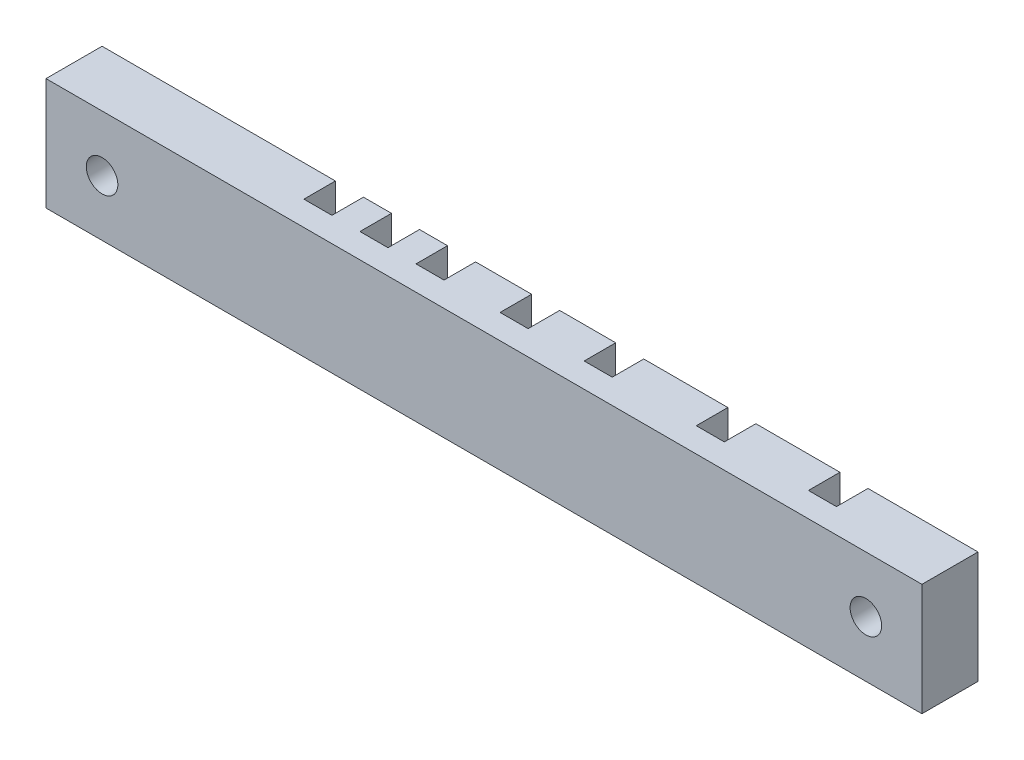
ISO-10303-21;
HEADER;
FILE_DESCRIPTION(('STEP AP214'),'2;1');
FILE_NAME('part.step','',(''),(''),'','','');
FILE_SCHEMA(('AUTOMOTIVE_DESIGN { 1 0 10303 214 1 1 1 1 }'));
ENDSEC;
DATA;
#1=APPLICATION_CONTEXT('core data for automotive mechanical design processes');
#2=APPLICATION_PROTOCOL_DEFINITION('international standard','automotive_design',2000,#1);
#3=PRODUCT_CONTEXT('',#1,'mechanical');
#4=PRODUCT('Part','Part','',(#3));
#5=PRODUCT_RELATED_PRODUCT_CATEGORY('part','',(#4));
#6=PRODUCT_DEFINITION_FORMATION('','',#4);
#7=PRODUCT_DEFINITION_CONTEXT('part definition',#1,'design');
#8=PRODUCT_DEFINITION('design','',#6,#7);
#9=PRODUCT_DEFINITION_SHAPE('','',#8);
#10=(LENGTH_UNIT() NAMED_UNIT(*) SI_UNIT(.MILLI.,.METRE.));
#11=(NAMED_UNIT(*) PLANE_ANGLE_UNIT() SI_UNIT($,.RADIAN.));
#12=(NAMED_UNIT(*) SI_UNIT($,.STERADIAN.) SOLID_ANGLE_UNIT());
#13=UNCERTAINTY_MEASURE_WITH_UNIT(LENGTH_MEASURE(1.E-05),#10,'distance_accuracy_value','');
#14=(GEOMETRIC_REPRESENTATION_CONTEXT(3) GLOBAL_UNCERTAINTY_ASSIGNED_CONTEXT((#13)) GLOBAL_UNIT_ASSIGNED_CONTEXT((#10,
#11,#12)) REPRESENTATION_CONTEXT('',''));
#15=CARTESIAN_POINT('',(0.,0.,0.));
#16=DIRECTION('',(0.,0.,1.));
#17=DIRECTION('',(1.,0.,0.));
#18=AXIS2_PLACEMENT_3D('',#15,#16,#17);
#19=CARTESIAN_POINT('',(0.,0.,0.));
#20=DIRECTION('',(0.,0.,1.));
#21=DIRECTION('',(1.,0.,0.));
#22=AXIS2_PLACEMENT_3D('',#19,#20,#21);
#23=PLANE('',#22);
#24=DIRECTION('',(1.,0.,0.));
#25=VECTOR('',#24,1.);
#26=CARTESIAN_POINT('',(-58.792924037461,-1.75702393340271,0.));
#27=LINE('',#26,#25);
#28=CARTESIAN_POINT('',(34.507075962539,-1.75702393340271,0.));
#29=VERTEX_POINT('',#28);
#30=CARTESIAN_POINT('',(46.507075962539,-1.75702393340271,0.));
#31=VERTEX_POINT('',#30);
#32=EDGE_CURVE('E417',#29,#31,#27,.T.);
#33=ORIENTED_EDGE('',*,*,#32,.F.);
#34=DIRECTION('',(0.,1.,0.));
#35=VECTOR('',#34,1.);
#36=CARTESIAN_POINT('',(34.507075962539,0.,0.));
#37=LINE('',#36,#35);
#38=CARTESIAN_POINT('',(34.507075962539,14.2429760665973,0.));
#39=VERTEX_POINT('',#38);
#40=EDGE_CURVE('E11',#29,#39,#37,.T.);
#41=ORIENTED_EDGE('',*,*,#40,.T.);
#42=DIRECTION('',(-1.,0.,0.));
#43=VECTOR('',#42,1.);
#44=CARTESIAN_POINT('',(-58.792924037461,14.2429760665973,0.));
#45=LINE('',#44,#43);
#46=CARTESIAN_POINT('',(46.507075962539,14.2429760665973,0.));
#47=VERTEX_POINT('',#46);
#48=EDGE_CURVE('E422',#47,#39,#45,.T.);
#49=ORIENTED_EDGE('',*,*,#48,.F.);
#50=DIRECTION('',(0.,-1.,0.));
#51=VECTOR('',#50,1.);
#52=CARTESIAN_POINT('',(46.507075962539,0.,0.));
#53=LINE('',#52,#51);
#54=EDGE_CURVE('E434',#47,#31,#53,.T.);
#55=ORIENTED_EDGE('',*,*,#54,.T.);
#56=EDGE_LOOP('',(#33,#41,#49,#55));
#57=FACE_BOUND('',#56,.T.);
#58=ADVANCED_FACE('F33',(#57),#23,.F.);
#59=CARTESIAN_POINT('',(30.507075962539,14.2429760665973,0.));
#60=VERTEX_POINT('',#59);
#61=CARTESIAN_POINT('',(18.507075962539,14.2429760665973,0.));
#62=VERTEX_POINT('',#61);
#63=EDGE_CURVE('E472',#60,#62,#45,.T.);
#64=ORIENTED_EDGE('',*,*,#63,.F.);
#65=DIRECTION('',(0.,-1.,0.));
#66=VECTOR('',#65,1.);
#67=CARTESIAN_POINT('',(30.507075962539,0.,0.));
#68=LINE('',#67,#66);
#69=CARTESIAN_POINT('',(30.507075962539,-1.75702393340271,0.));
#70=VERTEX_POINT('',#69);
#71=EDGE_CURVE('E41',#60,#70,#68,.T.);
#72=ORIENTED_EDGE('',*,*,#71,.T.);
#73=CARTESIAN_POINT('',(18.507075962539,-1.75702393340271,0.));
#74=VERTEX_POINT('',#73);
#75=EDGE_CURVE('E261',#74,#70,#27,.T.);
#76=ORIENTED_EDGE('',*,*,#75,.F.);
#77=DIRECTION('',(0.,1.,0.));
#78=VECTOR('',#77,1.);
#79=CARTESIAN_POINT('',(18.507075962539,0.,0.));
#80=LINE('',#79,#78);
#81=EDGE_CURVE('E466',#74,#62,#80,.T.);
#82=ORIENTED_EDGE('',*,*,#81,.T.);
#83=EDGE_LOOP('',(#64,#72,#76,#82));
#84=FACE_BOUND('',#83,.T.);
#85=ADVANCED_FACE('F470',(#84),#23,.F.);
#86=CARTESIAN_POINT('',(14.507075962539,14.2429760665973,0.));
#87=VERTEX_POINT('',#86);
#88=CARTESIAN_POINT('',(6.50707596253902,14.2429760665973,0.));
#89=VERTEX_POINT('',#88);
#90=EDGE_CURVE('E503',#87,#89,#45,.T.);
#91=ORIENTED_EDGE('',*,*,#90,.F.);
#92=DIRECTION('',(0.,-1.,0.));
#93=VECTOR('',#92,1.);
#94=CARTESIAN_POINT('',(14.507075962539,0.,0.));
#95=LINE('',#94,#93);
#96=CARTESIAN_POINT('',(14.507075962539,-1.75702393340271,0.));
#97=VERTEX_POINT('',#96);
#98=EDGE_CURVE('E464',#87,#97,#95,.T.);
#99=ORIENTED_EDGE('',*,*,#98,.T.);
#100=CARTESIAN_POINT('',(6.50707596253902,-1.75702393340271,0.));
#101=VERTEX_POINT('',#100);
#102=EDGE_CURVE('E485',#101,#97,#27,.T.);
#103=ORIENTED_EDGE('',*,*,#102,.F.);
#104=DIRECTION('',(0.,1.,0.));
#105=VECTOR('',#104,1.);
#106=CARTESIAN_POINT('',(6.50707596253902,0.,0.));
#107=LINE('',#106,#105);
#108=EDGE_CURVE('E461',#101,#89,#107,.T.);
#109=ORIENTED_EDGE('',*,*,#108,.T.);
#110=EDGE_LOOP('',(#91,#99,#103,#109));
#111=FACE_BOUND('',#110,.T.);
#112=ADVANCED_FACE('F501',(#111),#23,.F.);
#113=CARTESIAN_POINT('',(2.50707596253902,14.2429760665973,0.));
#114=VERTEX_POINT('',#113);
#115=CARTESIAN_POINT('',(-5.49292403746098,14.2429760665973,0.));
#116=VERTEX_POINT('',#115);
#117=EDGE_CURVE('E617',#114,#116,#45,.T.);
#118=ORIENTED_EDGE('',*,*,#117,.F.);
#119=DIRECTION('',(0.,-1.,0.));
#120=VECTOR('',#119,1.);
#121=CARTESIAN_POINT('',(2.50707596253902,0.,0.));
#122=LINE('',#121,#120);
#123=CARTESIAN_POINT('',(2.50707596253902,-1.75702393340271,0.));
#124=VERTEX_POINT('',#123);
#125=EDGE_CURVE('E458',#114,#124,#122,.T.);
#126=ORIENTED_EDGE('',*,*,#125,.T.);
#127=CARTESIAN_POINT('',(-5.49292403746098,-1.75702393340271,0.));
#128=VERTEX_POINT('',#127);
#129=EDGE_CURVE('E492',#128,#124,#27,.T.);
#130=ORIENTED_EDGE('',*,*,#129,.F.);
#131=DIRECTION('',(0.,1.,0.));
#132=VECTOR('',#131,1.);
#133=CARTESIAN_POINT('',(-5.49292403746098,0.,0.));
#134=LINE('',#133,#132);
#135=EDGE_CURVE('E455',#128,#116,#134,.T.);
#136=ORIENTED_EDGE('',*,*,#135,.T.);
#137=EDGE_LOOP('',(#118,#126,#130,#136));
#138=FACE_BOUND('',#137,.T.);
#139=ADVANCED_FACE('F616',(#138),#23,.F.);
#140=CARTESIAN_POINT('',(-9.49292403746098,14.2429760665973,0.));
#141=VERTEX_POINT('',#140);
#142=CARTESIAN_POINT('',(-13.492924037461,14.2429760665973,0.));
#143=VERTEX_POINT('',#142);
#144=EDGE_CURVE('E602',#141,#143,#45,.T.);
#145=ORIENTED_EDGE('',*,*,#144,.F.);
#146=DIRECTION('',(0.,-1.,0.));
#147=VECTOR('',#146,1.);
#148=CARTESIAN_POINT('',(-9.49292403746098,0.,0.));
#149=LINE('',#148,#147);
#150=CARTESIAN_POINT('',(-9.49292403746097,-1.75702393340271,0.));
#151=VERTEX_POINT('',#150);
#152=EDGE_CURVE('E452',#141,#151,#149,.T.);
#153=ORIENTED_EDGE('',*,*,#152,.T.);
#154=CARTESIAN_POINT('',(-13.492924037461,-1.75702393340271,0.));
#155=VERTEX_POINT('',#154);
#156=EDGE_CURVE('E489',#155,#151,#27,.T.);
#157=ORIENTED_EDGE('',*,*,#156,.F.);
#158=DIRECTION('',(0.,1.,0.));
#159=VECTOR('',#158,1.);
#160=CARTESIAN_POINT('',(-13.492924037461,0.,0.));
#161=LINE('',#160,#159);
#162=EDGE_CURVE('E449',#155,#143,#161,.T.);
#163=ORIENTED_EDGE('',*,*,#162,.T.);
#164=EDGE_LOOP('',(#145,#153,#157,#163));
#165=FACE_BOUND('',#164,.T.);
#166=ADVANCED_FACE('F556',(#165),#23,.F.);
#167=CARTESIAN_POINT('',(-17.492924037461,14.2429760665973,0.));
#168=VERTEX_POINT('',#167);
#169=CARTESIAN_POINT('',(-21.492924037461,14.2429760665973,0.));
#170=VERTEX_POINT('',#169);
#171=EDGE_CURVE('E588',#168,#170,#45,.T.);
#172=ORIENTED_EDGE('',*,*,#171,.F.);
#173=DIRECTION('',(0.,-1.,0.));
#174=VECTOR('',#173,1.);
#175=CARTESIAN_POINT('',(-17.492924037461,0.,0.));
#176=LINE('',#175,#174);
#177=CARTESIAN_POINT('',(-17.492924037461,-1.75702393340271,0.));
#178=VERTEX_POINT('',#177);
#179=EDGE_CURVE('E446',#168,#178,#176,.T.);
#180=ORIENTED_EDGE('',*,*,#179,.T.);
#181=CARTESIAN_POINT('',(-21.492924037461,-1.75702393340271,0.));
#182=VERTEX_POINT('',#181);
#183=EDGE_CURVE('E416',#182,#178,#27,.T.);
#184=ORIENTED_EDGE('',*,*,#183,.F.);
#185=DIRECTION('',(0.,1.,0.));
#186=VECTOR('',#185,1.);
#187=CARTESIAN_POINT('',(-21.492924037461,0.,0.));
#188=LINE('',#187,#186);
#189=EDGE_CURVE('E443',#182,#170,#188,.T.);
#190=ORIENTED_EDGE('',*,*,#189,.T.);
#191=EDGE_LOOP('',(#172,#180,#184,#190));
#192=FACE_BOUND('',#191,.T.);
#193=ADVANCED_FACE('F549',(#192),#23,.F.);
#194=CARTESIAN_POINT('',(58.207075962539,6.24297606659729,0.));
#195=DIRECTION('',(0.,0.,-1.));
#196=DIRECTION('',(-1.,0.,0.));
#197=AXIS2_PLACEMENT_3D('',#194,#195,#196);
#198=CIRCLE('',#197,4.00000000000001);
#199=CARTESIAN_POINT('',(54.207075962539,6.24297606659729,0.));
#200=VERTEX_POINT('',#199);
#201=EDGE_CURVE('E561',#200,#200,#198,.T.);
#202=ORIENTED_EDGE('',*,*,#201,.F.);
#203=EDGE_LOOP('',(#202));
#204=FACE_BOUND('',#203,.T.);
#205=CARTESIAN_POINT('',(50.507075962539,-1.75702393340271,0.));
#206=VERTEX_POINT('',#205);
#207=CARTESIAN_POINT('',(66.207075962539,-1.75702393340271,0.));
#208=VERTEX_POINT('',#207);
#209=EDGE_CURVE('E411',#206,#208,#27,.T.);
#210=ORIENTED_EDGE('',*,*,#209,.F.);
#211=DIRECTION('',(0.,1.,0.));
#212=VECTOR('',#211,1.);
#213=CARTESIAN_POINT('',(50.507075962539,0.,0.));
#214=LINE('',#213,#212);
#215=CARTESIAN_POINT('',(50.507075962539,14.2429760665973,0.));
#216=VERTEX_POINT('',#215);
#217=EDGE_CURVE('E437',#206,#216,#214,.T.);
#218=ORIENTED_EDGE('',*,*,#217,.T.);
#219=CARTESIAN_POINT('',(66.207075962539,14.2429760665973,0.));
#220=VERTEX_POINT('',#219);
#221=EDGE_CURVE('E402',#220,#216,#45,.T.);
#222=ORIENTED_EDGE('',*,*,#221,.F.);
#223=DIRECTION('',(0.,1.,0.));
#224=VECTOR('',#223,1.);
#225=CARTESIAN_POINT('',(66.207075962539,14.2429760665973,0.));
#226=LINE('',#225,#224);
#227=EDGE_CURVE('E415',#208,#220,#226,.T.);
#228=ORIENTED_EDGE('',*,*,#227,.F.);
#229=EDGE_LOOP('',(#210,#218,#222,#228));
#230=FACE_BOUND('',#229,.T.);
#231=ADVANCED_FACE('F537',(#204,#230),#23,.F.);
#232=CARTESIAN_POINT('',(-58.792924037461,14.2429760665973,8.));
#233=DIRECTION('',(1.,0.,0.));
#234=DIRECTION('',(0.,0.,-1.));
#235=AXIS2_PLACEMENT_3D('',#232,#233,#234);
#236=PLANE('',#235);
#237=DIRECTION('',(0.,-1.,0.));
#238=VECTOR('',#237,1.);
#239=CARTESIAN_POINT('',(-58.792924037461,14.2429760665973,0.));
#240=LINE('',#239,#238);
#241=CARTESIAN_POINT('',(-58.792924037461,14.2429760665973,0.));
#242=VERTEX_POINT('',#241);
#243=CARTESIAN_POINT('',(-58.792924037461,-1.75702393340271,0.));
#244=VERTEX_POINT('',#243);
#245=EDGE_CURVE('E395',#242,#244,#240,.T.);
#246=ORIENTED_EDGE('',*,*,#245,.T.);
#247=DIRECTION('',(0.,0.,-1.));
#248=VECTOR('',#247,1.);
#249=CARTESIAN_POINT('',(-58.792924037461,-1.75702393340271,8.));
#250=LINE('',#249,#248);
#251=CARTESIAN_POINT('',(-58.792924037461,-1.75702393340271,8.));
#252=VERTEX_POINT('',#251);
#253=EDGE_CURVE('E431',#252,#244,#250,.T.);
#254=ORIENTED_EDGE('',*,*,#253,.F.);
#255=DIRECTION('',(0.,-1.,0.));
#256=VECTOR('',#255,1.);
#257=CARTESIAN_POINT('',(-58.792924037461,14.2429760665973,8.));
#258=LINE('',#257,#256);
#259=CARTESIAN_POINT('',(-58.792924037461,14.2429760665973,8.));
#260=VERTEX_POINT('',#259);
#261=EDGE_CURVE('E398',#260,#252,#258,.T.);
#262=ORIENTED_EDGE('',*,*,#261,.F.);
#263=DIRECTION('',(0.,0.,-1.));
#264=VECTOR('',#263,1.);
#265=CARTESIAN_POINT('',(-58.792924037461,14.2429760665973,8.));
#266=LINE('',#265,#264);
#267=EDGE_CURVE('E408',#260,#242,#266,.T.);
#268=ORIENTED_EDGE('',*,*,#267,.T.);
#269=EDGE_LOOP('',(#246,#254,#262,#268));
#270=FACE_BOUND('',#269,.T.);
#271=ADVANCED_FACE('F35',(#270),#236,.F.);
#272=CARTESIAN_POINT('',(-58.792924037461,-1.75702393340271,8.));
#273=DIRECTION('',(0.,1.,0.));
#274=DIRECTION('',(0.,0.,1.));
#275=AXIS2_PLACEMENT_3D('',#272,#273,#274);
#276=PLANE('',#275);
#277=DIRECTION('',(1.,0.,0.));
#278=VECTOR('',#277,1.);
#279=CARTESIAN_POINT('',(34.507075962539,-1.75702393340271,4.5));
#280=LINE('',#279,#278);
#281=CARTESIAN_POINT('',(30.507075962539,-1.75702393340271,4.5));
#282=VERTEX_POINT('',#281);
#283=CARTESIAN_POINT('',(34.507075962539,-1.75702393340271,4.5));
#284=VERTEX_POINT('',#283);
#285=EDGE_CURVE('E249',#282,#284,#280,.T.);
#286=ORIENTED_EDGE('',*,*,#285,.T.);
#287=DIRECTION('',(0.,0.,-1.));
#288=VECTOR('',#287,1.);
#289=CARTESIAN_POINT('',(34.507075962539,-1.75702393340271,4.5));
#290=LINE('',#289,#288);
#291=EDGE_CURVE('E262',#284,#29,#290,.T.);
#292=ORIENTED_EDGE('',*,*,#291,.T.);
#293=ORIENTED_EDGE('',*,*,#32,.T.);
#294=DIRECTION('',(0.,0.,1.));
#295=VECTOR('',#294,1.);
#296=CARTESIAN_POINT('',(46.507075962539,-1.75702393340271,4.5));
#297=LINE('',#296,#295);
#298=CARTESIAN_POINT('',(46.507075962539,-1.75702393340271,4.5));
#299=VERTEX_POINT('',#298);
#300=EDGE_CURVE('E380',#31,#299,#297,.T.);
#301=ORIENTED_EDGE('',*,*,#300,.T.);
#302=DIRECTION('',(1.,0.,0.));
#303=VECTOR('',#302,1.);
#304=CARTESIAN_POINT('',(50.507075962539,-1.75702393340271,4.5));
#305=LINE('',#304,#303);
#306=CARTESIAN_POINT('',(50.507075962539,-1.75702393340271,4.5));
#307=VERTEX_POINT('',#306);
#308=EDGE_CURVE('E384',#299,#307,#305,.T.);
#309=ORIENTED_EDGE('',*,*,#308,.T.);
#310=DIRECTION('',(0.,0.,-1.));
#311=VECTOR('',#310,1.);
#312=CARTESIAN_POINT('',(50.507075962539,-1.75702393340271,4.5));
#313=LINE('',#312,#311);
#314=EDGE_CURVE('E377',#307,#206,#313,.T.);
#315=ORIENTED_EDGE('',*,*,#314,.T.);
#316=ORIENTED_EDGE('',*,*,#209,.T.);
#317=DIRECTION('',(0.,0.,-1.));
#318=VECTOR('',#317,1.);
#319=CARTESIAN_POINT('',(66.207075962539,-1.75702393340271,8.));
#320=LINE('',#319,#318);
#321=CARTESIAN_POINT('',(66.207075962539,-1.75702393340271,8.));
#322=VERTEX_POINT('',#321);
#323=EDGE_CURVE('E428',#322,#208,#320,.T.);
#324=ORIENTED_EDGE('',*,*,#323,.F.);
#325=DIRECTION('',(1.,0.,0.));
#326=VECTOR('',#325,1.);
#327=CARTESIAN_POINT('',(-58.792924037461,-1.75702393340271,8.));
#328=LINE('',#327,#326);
#329=EDGE_CURVE('E401',#252,#322,#328,.T.);
#330=ORIENTED_EDGE('',*,*,#329,.F.);
#331=ORIENTED_EDGE('',*,*,#253,.T.);
#332=CARTESIAN_POINT('',(-25.492924037461,-1.75702393340271,0.));
#333=VERTEX_POINT('',#332);
#334=EDGE_CURVE('E412',#244,#333,#27,.T.);
#335=ORIENTED_EDGE('',*,*,#334,.T.);
#336=DIRECTION('',(0.,0.,1.));
#337=VECTOR('',#336,1.);
#338=CARTESIAN_POINT('',(-25.492924037461,-1.75702393340271,4.5));
#339=LINE('',#338,#337);
#340=CARTESIAN_POINT('',(-25.492924037461,-1.75702393340271,4.5));
#341=VERTEX_POINT('',#340);
#342=EDGE_CURVE('E359',#333,#341,#339,.T.);
#343=ORIENTED_EDGE('',*,*,#342,.T.);
#344=DIRECTION('',(1.,0.,0.));
#345=VECTOR('',#344,1.);
#346=CARTESIAN_POINT('',(-21.492924037461,-1.75702393340271,4.5));
#347=LINE('',#346,#345);
#348=CARTESIAN_POINT('',(-21.492924037461,-1.75702393340271,4.5));
#349=VERTEX_POINT('',#348);
#350=EDGE_CURVE('E363',#341,#349,#347,.T.);
#351=ORIENTED_EDGE('',*,*,#350,.T.);
#352=DIRECTION('',(0.,0.,-1.));
#353=VECTOR('',#352,1.);
#354=CARTESIAN_POINT('',(-21.492924037461,-1.75702393340271,4.5));
#355=LINE('',#354,#353);
#356=EDGE_CURVE('E356',#349,#182,#355,.T.);
#357=ORIENTED_EDGE('',*,*,#356,.T.);
#358=ORIENTED_EDGE('',*,*,#183,.T.);
#359=DIRECTION('',(0.,0.,1.));
#360=VECTOR('',#359,1.);
#361=CARTESIAN_POINT('',(-17.492924037461,-1.75702393340271,4.5));
#362=LINE('',#361,#360);
#363=CARTESIAN_POINT('',(-17.492924037461,-1.75702393340271,4.5));
#364=VERTEX_POINT('',#363);
#365=EDGE_CURVE('E338',#178,#364,#362,.T.);
#366=ORIENTED_EDGE('',*,*,#365,.T.);
#367=DIRECTION('',(1.,0.,0.));
#368=VECTOR('',#367,1.);
#369=CARTESIAN_POINT('',(-13.492924037461,-1.75702393340271,4.5));
#370=LINE('',#369,#368);
#371=CARTESIAN_POINT('',(-13.492924037461,-1.75702393340271,4.5));
#372=VERTEX_POINT('',#371);
#373=EDGE_CURVE('E342',#364,#372,#370,.T.);
#374=ORIENTED_EDGE('',*,*,#373,.T.);
#375=DIRECTION('',(0.,0.,-1.));
#376=VECTOR('',#375,1.);
#377=CARTESIAN_POINT('',(-13.492924037461,-1.75702393340271,4.5));
#378=LINE('',#377,#376);
#379=EDGE_CURVE('E335',#372,#155,#378,.T.);
#380=ORIENTED_EDGE('',*,*,#379,.T.);
#381=ORIENTED_EDGE('',*,*,#156,.T.);
#382=DIRECTION('',(0.,0.,1.));
#383=VECTOR('',#382,1.);
#384=CARTESIAN_POINT('',(-9.49292403746098,-1.75702393340271,4.5));
#385=LINE('',#384,#383);
#386=CARTESIAN_POINT('',(-9.49292403746098,-1.75702393340271,4.5));
#387=VERTEX_POINT('',#386);
#388=EDGE_CURVE('E317',#151,#387,#385,.T.);
#389=ORIENTED_EDGE('',*,*,#388,.T.);
#390=DIRECTION('',(1.,0.,0.));
#391=VECTOR('',#390,1.);
#392=CARTESIAN_POINT('',(-5.49292403746098,-1.75702393340271,4.5));
#393=LINE('',#392,#391);
#394=CARTESIAN_POINT('',(-5.49292403746098,-1.75702393340271,4.5));
#395=VERTEX_POINT('',#394);
#396=EDGE_CURVE('E321',#387,#395,#393,.T.);
#397=ORIENTED_EDGE('',*,*,#396,.T.);
#398=DIRECTION('',(0.,0.,-1.));
#399=VECTOR('',#398,1.);
#400=CARTESIAN_POINT('',(-5.49292403746098,-1.75702393340271,4.5));
#401=LINE('',#400,#399);
#402=EDGE_CURVE('E314',#395,#128,#401,.T.);
#403=ORIENTED_EDGE('',*,*,#402,.T.);
#404=ORIENTED_EDGE('',*,*,#129,.T.);
#405=DIRECTION('',(0.,0.,1.));
#406=VECTOR('',#405,1.);
#407=CARTESIAN_POINT('',(2.50707596253902,-1.75702393340271,4.5));
#408=LINE('',#407,#406);
#409=CARTESIAN_POINT('',(2.50707596253902,-1.75702393340271,4.5));
#410=VERTEX_POINT('',#409);
#411=EDGE_CURVE('E296',#124,#410,#408,.T.);
#412=ORIENTED_EDGE('',*,*,#411,.T.);
#413=DIRECTION('',(1.,0.,0.));
#414=VECTOR('',#413,1.);
#415=CARTESIAN_POINT('',(6.50707596253902,-1.75702393340271,4.5));
#416=LINE('',#415,#414);
#417=CARTESIAN_POINT('',(6.50707596253902,-1.75702393340271,4.5));
#418=VERTEX_POINT('',#417);
#419=EDGE_CURVE('E300',#410,#418,#416,.T.);
#420=ORIENTED_EDGE('',*,*,#419,.T.);
#421=DIRECTION('',(0.,0.,-1.));
#422=VECTOR('',#421,1.);
#423=CARTESIAN_POINT('',(6.50707596253902,-1.75702393340271,4.5));
#424=LINE('',#423,#422);
#425=EDGE_CURVE('E293',#418,#101,#424,.T.);
#426=ORIENTED_EDGE('',*,*,#425,.T.);
#427=ORIENTED_EDGE('',*,*,#102,.T.);
#428=DIRECTION('',(0.,0.,1.));
#429=VECTOR('',#428,1.);
#430=CARTESIAN_POINT('',(14.507075962539,-1.75702393340271,4.5));
#431=LINE('',#430,#429);
#432=CARTESIAN_POINT('',(14.507075962539,-1.75702393340271,4.5));
#433=VERTEX_POINT('',#432);
#434=EDGE_CURVE('E56',#97,#433,#431,.T.);
#435=ORIENTED_EDGE('',*,*,#434,.T.);
#436=DIRECTION('',(1.,0.,0.));
#437=VECTOR('',#436,1.);
#438=CARTESIAN_POINT('',(18.507075962539,-1.75702393340271,4.5));
#439=LINE('',#438,#437);
#440=CARTESIAN_POINT('',(18.507075962539,-1.75702393340271,4.5));
#441=VERTEX_POINT('',#440);
#442=EDGE_CURVE('E279',#433,#441,#439,.T.);
#443=ORIENTED_EDGE('',*,*,#442,.T.);
#444=DIRECTION('',(0.,0.,-1.));
#445=VECTOR('',#444,1.);
#446=CARTESIAN_POINT('',(18.507075962539,-1.75702393340271,4.5));
#447=LINE('',#446,#445);
#448=EDGE_CURVE('E275',#441,#74,#447,.T.);
#449=ORIENTED_EDGE('',*,*,#448,.T.);
#450=ORIENTED_EDGE('',*,*,#75,.T.);
#451=DIRECTION('',(0.,0.,1.));
#452=VECTOR('',#451,1.);
#453=CARTESIAN_POINT('',(30.507075962539,-1.75702393340271,4.5));
#454=LINE('',#453,#452);
#455=EDGE_CURVE('E48',#70,#282,#454,.T.);
#456=ORIENTED_EDGE('',*,*,#455,.T.);
#457=EDGE_LOOP('',(#286,#292,#293,#301,#309,#315,#316,#324,#330,#331,#335,#343,#351,#357,#358,
#366,#374,#380,#381,#389,#397,#403,#404,#412,#420,#426,#427,#435,#443,#449,#450,#456));
#458=FACE_BOUND('',#457,.T.);
#459=ADVANCED_FACE('F258',(#458),#276,.F.);
#460=CARTESIAN_POINT('',(66.207075962539,14.2429760665973,8.));
#461=DIRECTION('',(-1.,0.,0.));
#462=DIRECTION('',(0.,0.,1.));
#463=AXIS2_PLACEMENT_3D('',#460,#461,#462);
#464=PLANE('',#463);
#465=ORIENTED_EDGE('',*,*,#227,.T.);
#466=DIRECTION('',(0.,0.,-1.));
#467=VECTOR('',#466,1.);
#468=CARTESIAN_POINT('',(66.207075962539,14.2429760665973,8.));
#469=LINE('',#468,#467);
#470=CARTESIAN_POINT('',(66.207075962539,14.2429760665973,8.));
#471=VERTEX_POINT('',#470);
#472=EDGE_CURVE('E425',#471,#220,#469,.T.);
#473=ORIENTED_EDGE('',*,*,#472,.F.);
#474=DIRECTION('',(0.,1.,0.));
#475=VECTOR('',#474,1.);
#476=CARTESIAN_POINT('',(66.207075962539,14.2429760665973,8.));
#477=LINE('',#476,#475);
#478=EDGE_CURVE('E404',#322,#471,#477,.T.);
#479=ORIENTED_EDGE('',*,*,#478,.F.);
#480=ORIENTED_EDGE('',*,*,#323,.T.);
#481=EDGE_LOOP('',(#465,#473,#479,#480));
#482=FACE_BOUND('',#481,.T.);
#483=ADVANCED_FACE('F566',(#482),#464,.F.);
#484=CARTESIAN_POINT('',(-58.792924037461,14.2429760665973,8.));
#485=DIRECTION('',(0.,-1.,0.));
#486=DIRECTION('',(0.,0.,-1.));
#487=AXIS2_PLACEMENT_3D('',#484,#485,#486);
#488=PLANE('',#487);
#489=ORIENTED_EDGE('',*,*,#48,.T.);
#490=DIRECTION('',(0.,0.,-1.));
#491=VECTOR('',#490,1.);
#492=CARTESIAN_POINT('',(34.507075962539,14.2429760665973,4.5));
#493=LINE('',#492,#491);
#494=CARTESIAN_POINT('',(34.507075962539,14.2429760665973,4.5));
#495=VERTEX_POINT('',#494);
#496=EDGE_CURVE('E268',#495,#39,#493,.T.);
#497=ORIENTED_EDGE('',*,*,#496,.F.);
#498=DIRECTION('',(1.,0.,0.));
#499=VECTOR('',#498,1.);
#500=CARTESIAN_POINT('',(34.507075962539,14.2429760665973,4.5));
#501=LINE('',#500,#499);
#502=CARTESIAN_POINT('',(30.507075962539,14.2429760665973,4.5));
#503=VERTEX_POINT('',#502);
#504=EDGE_CURVE('E264',#503,#495,#501,.T.);
#505=ORIENTED_EDGE('',*,*,#504,.F.);
#506=DIRECTION('',(0.,0.,1.));
#507=VECTOR('',#506,1.);
#508=CARTESIAN_POINT('',(30.507075962539,14.2429760665973,4.5));
#509=LINE('',#508,#507);
#510=EDGE_CURVE('E244',#60,#503,#509,.T.);
#511=ORIENTED_EDGE('',*,*,#510,.F.);
#512=ORIENTED_EDGE('',*,*,#63,.T.);
#513=DIRECTION('',(0.,0.,-1.));
#514=VECTOR('',#513,1.);
#515=CARTESIAN_POINT('',(18.507075962539,14.2429760665973,4.5));
#516=LINE('',#515,#514);
#517=CARTESIAN_POINT('',(18.507075962539,14.2429760665973,4.5));
#518=VERTEX_POINT('',#517);
#519=EDGE_CURVE('E283',#518,#62,#516,.T.);
#520=ORIENTED_EDGE('',*,*,#519,.F.);
#521=DIRECTION('',(1.,0.,0.));
#522=VECTOR('',#521,1.);
#523=CARTESIAN_POINT('',(18.507075962539,14.2429760665973,4.5));
#524=LINE('',#523,#522);
#525=CARTESIAN_POINT('',(14.507075962539,14.2429760665973,4.5));
#526=VERTEX_POINT('',#525);
#527=EDGE_CURVE('E277',#526,#518,#524,.T.);
#528=ORIENTED_EDGE('',*,*,#527,.F.);
#529=DIRECTION('',(0.,0.,1.));
#530=VECTOR('',#529,1.);
#531=CARTESIAN_POINT('',(14.507075962539,14.2429760665973,4.5));
#532=LINE('',#531,#530);
#533=EDGE_CURVE('E285',#87,#526,#532,.T.);
#534=ORIENTED_EDGE('',*,*,#533,.F.);
#535=ORIENTED_EDGE('',*,*,#90,.T.);
#536=DIRECTION('',(0.,0.,-1.));
#537=VECTOR('',#536,1.);
#538=CARTESIAN_POINT('',(6.50707596253902,14.2429760665973,4.5));
#539=LINE('',#538,#537);
#540=CARTESIAN_POINT('',(6.50707596253902,14.2429760665973,4.5));
#541=VERTEX_POINT('',#540);
#542=EDGE_CURVE('E304',#541,#89,#539,.T.);
#543=ORIENTED_EDGE('',*,*,#542,.F.);
#544=DIRECTION('',(1.,0.,0.));
#545=VECTOR('',#544,1.);
#546=CARTESIAN_POINT('',(6.50707596253902,14.2429760665973,4.5));
#547=LINE('',#546,#545);
#548=CARTESIAN_POINT('',(2.50707596253902,14.2429760665973,4.5));
#549=VERTEX_POINT('',#548);
#550=EDGE_CURVE('E297',#549,#541,#547,.T.);
#551=ORIENTED_EDGE('',*,*,#550,.F.);
#552=DIRECTION('',(0.,0.,1.));
#553=VECTOR('',#552,1.);
#554=CARTESIAN_POINT('',(2.50707596253902,14.2429760665973,4.5));
#555=LINE('',#554,#553);
#556=EDGE_CURVE('E306',#114,#549,#555,.T.);
#557=ORIENTED_EDGE('',*,*,#556,.F.);
#558=ORIENTED_EDGE('',*,*,#117,.T.);
#559=DIRECTION('',(0.,0.,-1.));
#560=VECTOR('',#559,1.);
#561=CARTESIAN_POINT('',(-5.49292403746098,14.2429760665973,4.5));
#562=LINE('',#561,#560);
#563=CARTESIAN_POINT('',(-5.49292403746098,14.2429760665973,4.5));
#564=VERTEX_POINT('',#563);
#565=EDGE_CURVE('E325',#564,#116,#562,.T.);
#566=ORIENTED_EDGE('',*,*,#565,.F.);
#567=DIRECTION('',(1.,0.,0.));
#568=VECTOR('',#567,1.);
#569=CARTESIAN_POINT('',(-5.49292403746098,14.2429760665973,4.5));
#570=LINE('',#569,#568);
#571=CARTESIAN_POINT('',(-9.49292403746098,14.2429760665973,4.5));
#572=VERTEX_POINT('',#571);
#573=EDGE_CURVE('E318',#572,#564,#570,.T.);
#574=ORIENTED_EDGE('',*,*,#573,.F.);
#575=DIRECTION('',(0.,0.,1.));
#576=VECTOR('',#575,1.);
#577=CARTESIAN_POINT('',(-9.49292403746098,14.2429760665973,4.5));
#578=LINE('',#577,#576);
#579=EDGE_CURVE('E327',#141,#572,#578,.T.);
#580=ORIENTED_EDGE('',*,*,#579,.F.);
#581=ORIENTED_EDGE('',*,*,#144,.T.);
#582=DIRECTION('',(0.,0.,-1.));
#583=VECTOR('',#582,1.);
#584=CARTESIAN_POINT('',(-13.492924037461,14.2429760665973,4.5));
#585=LINE('',#584,#583);
#586=CARTESIAN_POINT('',(-13.492924037461,14.2429760665973,4.5));
#587=VERTEX_POINT('',#586);
#588=EDGE_CURVE('E346',#587,#143,#585,.T.);
#589=ORIENTED_EDGE('',*,*,#588,.F.);
#590=DIRECTION('',(1.,0.,0.));
#591=VECTOR('',#590,1.);
#592=CARTESIAN_POINT('',(-13.492924037461,14.2429760665973,4.5));
#593=LINE('',#592,#591);
#594=CARTESIAN_POINT('',(-17.492924037461,14.2429760665973,4.5));
#595=VERTEX_POINT('',#594);
#596=EDGE_CURVE('E339',#595,#587,#593,.T.);
#597=ORIENTED_EDGE('',*,*,#596,.F.);
#598=DIRECTION('',(0.,0.,1.));
#599=VECTOR('',#598,1.);
#600=CARTESIAN_POINT('',(-17.492924037461,14.2429760665973,4.5));
#601=LINE('',#600,#599);
#602=EDGE_CURVE('E348',#168,#595,#601,.T.);
#603=ORIENTED_EDGE('',*,*,#602,.F.);
#604=ORIENTED_EDGE('',*,*,#171,.T.);
#605=DIRECTION('',(0.,0.,-1.));
#606=VECTOR('',#605,1.);
#607=CARTESIAN_POINT('',(-21.492924037461,14.2429760665973,4.5));
#608=LINE('',#607,#606);
#609=CARTESIAN_POINT('',(-21.492924037461,14.2429760665973,4.5));
#610=VERTEX_POINT('',#609);
#611=EDGE_CURVE('E367',#610,#170,#608,.T.);
#612=ORIENTED_EDGE('',*,*,#611,.F.);
#613=DIRECTION('',(1.,0.,0.));
#614=VECTOR('',#613,1.);
#615=CARTESIAN_POINT('',(-21.492924037461,14.2429760665973,4.5));
#616=LINE('',#615,#614);
#617=CARTESIAN_POINT('',(-25.492924037461,14.2429760665973,4.5));
#618=VERTEX_POINT('',#617);
#619=EDGE_CURVE('E360',#618,#610,#616,.T.);
#620=ORIENTED_EDGE('',*,*,#619,.F.);
#621=DIRECTION('',(0.,0.,1.));
#622=VECTOR('',#621,1.);
#623=CARTESIAN_POINT('',(-25.492924037461,14.2429760665973,4.5));
#624=LINE('',#623,#622);
#625=CARTESIAN_POINT('',(-25.492924037461,14.2429760665973,0.));
#626=VERTEX_POINT('',#625);
#627=EDGE_CURVE('E369',#626,#618,#624,.T.);
#628=ORIENTED_EDGE('',*,*,#627,.F.);
#629=EDGE_CURVE('E419',#626,#242,#45,.T.);
#630=ORIENTED_EDGE('',*,*,#629,.T.);
#631=ORIENTED_EDGE('',*,*,#267,.F.);
#632=DIRECTION('',(-1.,0.,0.));
#633=VECTOR('',#632,1.);
#634=CARTESIAN_POINT('',(-58.792924037461,14.2429760665973,8.));
#635=LINE('',#634,#633);
#636=EDGE_CURVE('E406',#471,#260,#635,.T.);
#637=ORIENTED_EDGE('',*,*,#636,.F.);
#638=ORIENTED_EDGE('',*,*,#472,.T.);
#639=ORIENTED_EDGE('',*,*,#221,.T.);
#640=DIRECTION('',(0.,0.,-1.));
#641=VECTOR('',#640,1.);
#642=CARTESIAN_POINT('',(50.507075962539,14.2429760665973,4.5));
#643=LINE('',#642,#641);
#644=CARTESIAN_POINT('',(50.507075962539,14.2429760665973,4.5));
#645=VERTEX_POINT('',#644);
#646=EDGE_CURVE('E273',#645,#216,#643,.T.);
#647=ORIENTED_EDGE('',*,*,#646,.F.);
#648=DIRECTION('',(1.,0.,0.));
#649=VECTOR('',#648,1.);
#650=CARTESIAN_POINT('',(50.507075962539,14.2429760665973,4.5));
#651=LINE('',#650,#649);
#652=CARTESIAN_POINT('',(46.507075962539,14.2429760665973,4.5));
#653=VERTEX_POINT('',#652);
#654=EDGE_CURVE('E381',#653,#645,#651,.T.);
#655=ORIENTED_EDGE('',*,*,#654,.F.);
#656=DIRECTION('',(0.,0.,1.));
#657=VECTOR('',#656,1.);
#658=CARTESIAN_POINT('',(46.507075962539,14.2429760665973,4.5));
#659=LINE('',#658,#657);
#660=EDGE_CURVE('E389',#47,#653,#659,.T.);
#661=ORIENTED_EDGE('',*,*,#660,.F.);
#662=EDGE_LOOP('',(#489,#497,#505,#511,#512,#520,#528,#534,#535,#543,#551,#557,#558,#566,#574,
#580,#581,#589,#597,#603,#604,#612,#620,#628,#630,#631,#637,#638,#639,#647,#655,#661));
#663=FACE_BOUND('',#662,.T.);
#664=ADVANCED_FACE('F475',(#663),#488,.F.);
#665=CARTESIAN_POINT('',(0.,0.,8.));
#666=DIRECTION('',(0.,0.,1.));
#667=DIRECTION('',(1.,0.,0.));
#668=AXIS2_PLACEMENT_3D('',#665,#666,#667);
#669=PLANE('',#668);
#670=CARTESIAN_POINT('',(58.207075962539,6.24297606659729,8.));
#671=DIRECTION('',(0.,0.,-1.));
#672=DIRECTION('',(-1.,0.,0.));
#673=AXIS2_PLACEMENT_3D('',#670,#671,#672);
#674=CIRCLE('',#673,2.25);
#675=CARTESIAN_POINT('',(55.957075962539,6.24297606659729,8.));
#676=VERTEX_POINT('',#675);
#677=EDGE_CURVE('E847',#676,#676,#674,.T.);
#678=ORIENTED_EDGE('',*,*,#677,.T.);
#679=EDGE_LOOP('',(#678));
#680=FACE_BOUND('',#679,.T.);
#681=CARTESIAN_POINT('',(-50.792924037461,6.24297606659729,8.));
#682=DIRECTION('',(0.,0.,-1.));
#683=DIRECTION('',(-1.,0.,0.));
#684=AXIS2_PLACEMENT_3D('',#681,#682,#683);
#685=CIRCLE('',#684,2.25);
#686=CARTESIAN_POINT('',(-53.042924037461,6.24297606659729,8.));
#687=VERTEX_POINT('',#686);
#688=EDGE_CURVE('E855',#687,#687,#685,.T.);
#689=ORIENTED_EDGE('',*,*,#688,.T.);
#690=EDGE_LOOP('',(#689));
#691=FACE_BOUND('',#690,.T.);
#692=ORIENTED_EDGE('',*,*,#261,.T.);
#693=ORIENTED_EDGE('',*,*,#329,.T.);
#694=ORIENTED_EDGE('',*,*,#478,.T.);
#695=ORIENTED_EDGE('',*,*,#636,.T.);
#696=EDGE_LOOP('',(#692,#693,#694,#695));
#697=FACE_BOUND('',#696,.T.);
#698=ADVANCED_FACE('F535',(#680,#691,#697),#669,.T.);
#699=CARTESIAN_POINT('',(-50.792924037461,6.24297606659729,0.));
#700=DIRECTION('',(0.,0.,-1.));
#701=DIRECTION('',(-1.,0.,0.));
#702=AXIS2_PLACEMENT_3D('',#699,#700,#701);
#703=CIRCLE('',#702,4.00000000000001);
#704=CARTESIAN_POINT('',(-54.792924037461,6.24297606659729,0.));
#705=VERTEX_POINT('',#704);
#706=EDGE_CURVE('E863',#705,#705,#703,.T.);
#707=ORIENTED_EDGE('',*,*,#706,.F.);
#708=EDGE_LOOP('',(#707));
#709=FACE_BOUND('',#708,.T.);
#710=ORIENTED_EDGE('',*,*,#629,.F.);
#711=DIRECTION('',(0.,-1.,0.));
#712=VECTOR('',#711,1.);
#713=CARTESIAN_POINT('',(-25.492924037461,0.,0.));
#714=LINE('',#713,#712);
#715=EDGE_CURVE('E440',#626,#333,#714,.T.);
#716=ORIENTED_EDGE('',*,*,#715,.T.);
#717=ORIENTED_EDGE('',*,*,#334,.F.);
#718=ORIENTED_EDGE('',*,*,#245,.F.);
#719=EDGE_LOOP('',(#710,#716,#717,#718));
#720=FACE_BOUND('',#719,.T.);
#721=ADVANCED_FACE('F527',(#709,#720),#23,.F.);
#722=CARTESIAN_POINT('',(50.507075962539,-1.75702393340271,4.5));
#723=DIRECTION('',(1.,0.,0.));
#724=DIRECTION('',(0.,0.,-1.));
#725=AXIS2_PLACEMENT_3D('',#722,#723,#724);
#726=PLANE('',#725);
#727=ORIENTED_EDGE('',*,*,#314,.F.);
#728=DIRECTION('',(0.,1.,0.));
#729=VECTOR('',#728,1.);
#730=CARTESIAN_POINT('',(50.507075962539,-1.75702393340271,4.5));
#731=LINE('',#730,#729);
#732=EDGE_CURVE('E393',#307,#645,#731,.T.);
#733=ORIENTED_EDGE('',*,*,#732,.T.);
#734=ORIENTED_EDGE('',*,*,#646,.T.);
#735=ORIENTED_EDGE('',*,*,#217,.F.);
#736=EDGE_LOOP('',(#727,#733,#734,#735));
#737=FACE_BOUND('',#736,.T.);
#738=ADVANCED_FACE('F534',(#737),#726,.F.);
#739=CARTESIAN_POINT('',(46.507075962539,-1.75702393340271,4.5));
#740=DIRECTION('',(-1.,0.,0.));
#741=DIRECTION('',(0.,0.,1.));
#742=AXIS2_PLACEMENT_3D('',#739,#740,#741);
#743=PLANE('',#742);
#744=ORIENTED_EDGE('',*,*,#660,.T.);
#745=DIRECTION('',(0.,1.,0.));
#746=VECTOR('',#745,1.);
#747=CARTESIAN_POINT('',(46.507075962539,-1.75702393340271,4.5));
#748=LINE('',#747,#746);
#749=EDGE_CURVE('E387',#299,#653,#748,.T.);
#750=ORIENTED_EDGE('',*,*,#749,.F.);
#751=ORIENTED_EDGE('',*,*,#300,.F.);
#752=ORIENTED_EDGE('',*,*,#54,.F.);
#753=EDGE_LOOP('',(#744,#750,#751,#752));
#754=FACE_BOUND('',#753,.T.);
#755=ADVANCED_FACE('F542',(#754),#743,.F.);
#756=CARTESIAN_POINT('',(50.507075962539,-1.75702393340271,4.5));
#757=DIRECTION('',(0.,0.,1.));
#758=DIRECTION('',(1.,0.,0.));
#759=AXIS2_PLACEMENT_3D('',#756,#757,#758);
#760=PLANE('',#759);
#761=ORIENTED_EDGE('',*,*,#654,.T.);
#762=ORIENTED_EDGE('',*,*,#732,.F.);
#763=ORIENTED_EDGE('',*,*,#308,.F.);
#764=ORIENTED_EDGE('',*,*,#749,.T.);
#765=EDGE_LOOP('',(#761,#762,#763,#764));
#766=FACE_BOUND('',#765,.T.);
#767=ADVANCED_FACE('F652',(#766),#760,.F.);
#768=CARTESIAN_POINT('',(-21.492924037461,-1.75702393340271,4.5));
#769=DIRECTION('',(1.,0.,0.));
#770=DIRECTION('',(0.,0.,-1.));
#771=AXIS2_PLACEMENT_3D('',#768,#769,#770);
#772=PLANE('',#771);
#773=ORIENTED_EDGE('',*,*,#356,.F.);
#774=DIRECTION('',(0.,1.,0.));
#775=VECTOR('',#774,1.);
#776=CARTESIAN_POINT('',(-21.492924037461,-1.75702393340271,4.5));
#777=LINE('',#776,#775);
#778=EDGE_CURVE('E349',#349,#610,#777,.T.);
#779=ORIENTED_EDGE('',*,*,#778,.T.);
#780=ORIENTED_EDGE('',*,*,#611,.T.);
#781=ORIENTED_EDGE('',*,*,#189,.F.);
#782=EDGE_LOOP('',(#773,#779,#780,#781));
#783=FACE_BOUND('',#782,.T.);
#784=ADVANCED_FACE('F649',(#783),#772,.F.);
#785=CARTESIAN_POINT('',(-25.492924037461,-1.75702393340271,4.5));
#786=DIRECTION('',(-1.,0.,0.));
#787=DIRECTION('',(0.,0.,1.));
#788=AXIS2_PLACEMENT_3D('',#785,#786,#787);
#789=PLANE('',#788);
#790=ORIENTED_EDGE('',*,*,#627,.T.);
#791=DIRECTION('',(0.,1.,0.));
#792=VECTOR('',#791,1.);
#793=CARTESIAN_POINT('',(-25.492924037461,-1.75702393340271,4.5));
#794=LINE('',#793,#792);
#795=EDGE_CURVE('E366',#341,#618,#794,.T.);
#796=ORIENTED_EDGE('',*,*,#795,.F.);
#797=ORIENTED_EDGE('',*,*,#342,.F.);
#798=ORIENTED_EDGE('',*,*,#715,.F.);
#799=EDGE_LOOP('',(#790,#796,#797,#798));
#800=FACE_BOUND('',#799,.T.);
#801=ADVANCED_FACE('F578',(#800),#789,.F.);
#802=CARTESIAN_POINT('',(-21.492924037461,-1.75702393340271,4.5));
#803=DIRECTION('',(0.,0.,1.));
#804=DIRECTION('',(1.,0.,0.));
#805=AXIS2_PLACEMENT_3D('',#802,#803,#804);
#806=PLANE('',#805);
#807=ORIENTED_EDGE('',*,*,#619,.T.);
#808=ORIENTED_EDGE('',*,*,#778,.F.);
#809=ORIENTED_EDGE('',*,*,#350,.F.);
#810=ORIENTED_EDGE('',*,*,#795,.T.);
#811=EDGE_LOOP('',(#807,#808,#809,#810));
#812=FACE_BOUND('',#811,.T.);
#813=ADVANCED_FACE('F583',(#812),#806,.F.);
#814=CARTESIAN_POINT('',(-13.492924037461,-1.75702393340271,4.5));
#815=DIRECTION('',(1.,0.,0.));
#816=DIRECTION('',(0.,0.,-1.));
#817=AXIS2_PLACEMENT_3D('',#814,#815,#816);
#818=PLANE('',#817);
#819=ORIENTED_EDGE('',*,*,#379,.F.);
#820=DIRECTION('',(0.,1.,0.));
#821=VECTOR('',#820,1.);
#822=CARTESIAN_POINT('',(-13.492924037461,-1.75702393340271,4.5));
#823=LINE('',#822,#821);
#824=EDGE_CURVE('E328',#372,#587,#823,.T.);
#825=ORIENTED_EDGE('',*,*,#824,.T.);
#826=ORIENTED_EDGE('',*,*,#588,.T.);
#827=ORIENTED_EDGE('',*,*,#162,.F.);
#828=EDGE_LOOP('',(#819,#825,#826,#827));
#829=FACE_BOUND('',#828,.T.);
#830=ADVANCED_FACE('F642',(#829),#818,.F.);
#831=CARTESIAN_POINT('',(-17.492924037461,-1.75702393340271,4.5));
#832=DIRECTION('',(-1.,0.,0.));
#833=DIRECTION('',(0.,0.,1.));
#834=AXIS2_PLACEMENT_3D('',#831,#832,#833);
#835=PLANE('',#834);
#836=ORIENTED_EDGE('',*,*,#602,.T.);
#837=DIRECTION('',(0.,1.,0.));
#838=VECTOR('',#837,1.);
#839=CARTESIAN_POINT('',(-17.492924037461,-1.75702393340271,4.5));
#840=LINE('',#839,#838);
#841=EDGE_CURVE('E345',#364,#595,#840,.T.);
#842=ORIENTED_EDGE('',*,*,#841,.F.);
#843=ORIENTED_EDGE('',*,*,#365,.F.);
#844=ORIENTED_EDGE('',*,*,#179,.F.);
#845=EDGE_LOOP('',(#836,#842,#843,#844));
#846=FACE_BOUND('',#845,.T.);
#847=ADVANCED_FACE('F591',(#846),#835,.F.);
#848=CARTESIAN_POINT('',(-13.492924037461,-1.75702393340271,4.5));
#849=DIRECTION('',(0.,0.,1.));
#850=DIRECTION('',(1.,0.,0.));
#851=AXIS2_PLACEMENT_3D('',#848,#849,#850);
#852=PLANE('',#851);
#853=ORIENTED_EDGE('',*,*,#596,.T.);
#854=ORIENTED_EDGE('',*,*,#824,.F.);
#855=ORIENTED_EDGE('',*,*,#373,.F.);
#856=ORIENTED_EDGE('',*,*,#841,.T.);
#857=EDGE_LOOP('',(#853,#854,#855,#856));
#858=FACE_BOUND('',#857,.T.);
#859=ADVANCED_FACE('F596',(#858),#852,.F.);
#860=CARTESIAN_POINT('',(-5.49292403746098,-1.75702393340271,4.5));
#861=DIRECTION('',(1.,0.,0.));
#862=DIRECTION('',(0.,0.,-1.));
#863=AXIS2_PLACEMENT_3D('',#860,#861,#862);
#864=PLANE('',#863);
#865=ORIENTED_EDGE('',*,*,#402,.F.);
#866=DIRECTION('',(0.,1.,0.));
#867=VECTOR('',#866,1.);
#868=CARTESIAN_POINT('',(-5.49292403746098,-1.75702393340271,4.5));
#869=LINE('',#868,#867);
#870=EDGE_CURVE('E307',#395,#564,#869,.T.);
#871=ORIENTED_EDGE('',*,*,#870,.T.);
#872=ORIENTED_EDGE('',*,*,#565,.T.);
#873=ORIENTED_EDGE('',*,*,#135,.F.);
#874=EDGE_LOOP('',(#865,#871,#872,#873));
#875=FACE_BOUND('',#874,.T.);
#876=ADVANCED_FACE('F635',(#875),#864,.F.);
#877=CARTESIAN_POINT('',(-9.49292403746098,-1.75702393340271,4.5));
#878=DIRECTION('',(-1.,0.,0.));
#879=DIRECTION('',(0.,0.,1.));
#880=AXIS2_PLACEMENT_3D('',#877,#878,#879);
#881=PLANE('',#880);
#882=ORIENTED_EDGE('',*,*,#579,.T.);
#883=DIRECTION('',(0.,1.,0.));
#884=VECTOR('',#883,1.);
#885=CARTESIAN_POINT('',(-9.49292403746098,-1.75702393340271,4.5));
#886=LINE('',#885,#884);
#887=EDGE_CURVE('E324',#387,#572,#886,.T.);
#888=ORIENTED_EDGE('',*,*,#887,.F.);
#889=ORIENTED_EDGE('',*,*,#388,.F.);
#890=ORIENTED_EDGE('',*,*,#152,.F.);
#891=EDGE_LOOP('',(#882,#888,#889,#890));
#892=FACE_BOUND('',#891,.T.);
#893=ADVANCED_FACE('F605',(#892),#881,.F.);
#894=CARTESIAN_POINT('',(-5.49292403746098,-1.75702393340271,4.5));
#895=DIRECTION('',(0.,0.,1.));
#896=DIRECTION('',(1.,0.,0.));
#897=AXIS2_PLACEMENT_3D('',#894,#895,#896);
#898=PLANE('',#897);
#899=ORIENTED_EDGE('',*,*,#573,.T.);
#900=ORIENTED_EDGE('',*,*,#870,.F.);
#901=ORIENTED_EDGE('',*,*,#396,.F.);
#902=ORIENTED_EDGE('',*,*,#887,.T.);
#903=EDGE_LOOP('',(#899,#900,#901,#902));
#904=FACE_BOUND('',#903,.T.);
#905=ADVANCED_FACE('F610',(#904),#898,.F.);
#906=CARTESIAN_POINT('',(6.50707596253902,-1.75702393340271,4.5));
#907=DIRECTION('',(1.,0.,0.));
#908=DIRECTION('',(0.,0.,-1.));
#909=AXIS2_PLACEMENT_3D('',#906,#907,#908);
#910=PLANE('',#909);
#911=ORIENTED_EDGE('',*,*,#425,.F.);
#912=DIRECTION('',(0.,1.,0.));
#913=VECTOR('',#912,1.);
#914=CARTESIAN_POINT('',(6.50707596253902,-1.75702393340271,4.5));
#915=LINE('',#914,#913);
#916=EDGE_CURVE('E286',#418,#541,#915,.T.);
#917=ORIENTED_EDGE('',*,*,#916,.T.);
#918=ORIENTED_EDGE('',*,*,#542,.T.);
#919=ORIENTED_EDGE('',*,*,#108,.F.);
#920=EDGE_LOOP('',(#911,#917,#918,#919));
#921=FACE_BOUND('',#920,.T.);
#922=ADVANCED_FACE('F623',(#921),#910,.F.);
#923=CARTESIAN_POINT('',(2.50707596253902,-1.75702393340271,4.5));
#924=DIRECTION('',(-1.,0.,0.));
#925=DIRECTION('',(0.,0.,1.));
#926=AXIS2_PLACEMENT_3D('',#923,#924,#925);
#927=PLANE('',#926);
#928=ORIENTED_EDGE('',*,*,#556,.T.);
#929=DIRECTION('',(0.,1.,0.));
#930=VECTOR('',#929,1.);
#931=CARTESIAN_POINT('',(2.50707596253902,-1.75702393340271,4.5));
#932=LINE('',#931,#930);
#933=EDGE_CURVE('E303',#410,#549,#932,.T.);
#934=ORIENTED_EDGE('',*,*,#933,.F.);
#935=ORIENTED_EDGE('',*,*,#411,.F.);
#936=ORIENTED_EDGE('',*,*,#125,.F.);
#937=EDGE_LOOP('',(#928,#934,#935,#936));
#938=FACE_BOUND('',#937,.T.);
#939=ADVANCED_FACE('F522',(#938),#927,.F.);
#940=CARTESIAN_POINT('',(6.50707596253902,-1.75702393340271,4.5));
#941=DIRECTION('',(0.,0.,1.));
#942=DIRECTION('',(1.,0.,0.));
#943=AXIS2_PLACEMENT_3D('',#940,#941,#942);
#944=PLANE('',#943);
#945=ORIENTED_EDGE('',*,*,#550,.T.);
#946=ORIENTED_EDGE('',*,*,#916,.F.);
#947=ORIENTED_EDGE('',*,*,#419,.F.);
#948=ORIENTED_EDGE('',*,*,#933,.T.);
#949=EDGE_LOOP('',(#945,#946,#947,#948));
#950=FACE_BOUND('',#949,.T.);
#951=ADVANCED_FACE('F515',(#950),#944,.F.);
#952=CARTESIAN_POINT('',(18.507075962539,-1.75702393340271,4.5));
#953=DIRECTION('',(1.,0.,0.));
#954=DIRECTION('',(0.,0.,-1.));
#955=AXIS2_PLACEMENT_3D('',#952,#953,#954);
#956=PLANE('',#955);
#957=ORIENTED_EDGE('',*,*,#448,.F.);
#958=DIRECTION('',(0.,1.,0.));
#959=VECTOR('',#958,1.);
#960=CARTESIAN_POINT('',(18.507075962539,-1.75702393340271,4.5));
#961=LINE('',#960,#959);
#962=EDGE_CURVE('E270',#441,#518,#961,.T.);
#963=ORIENTED_EDGE('',*,*,#962,.T.);
#964=ORIENTED_EDGE('',*,*,#519,.T.);
#965=ORIENTED_EDGE('',*,*,#81,.F.);
#966=EDGE_LOOP('',(#957,#963,#964,#965));
#967=FACE_BOUND('',#966,.T.);
#968=ADVANCED_FACE('F513',(#967),#956,.F.);
#969=CARTESIAN_POINT('',(14.507075962539,-1.75702393340271,4.5));
#970=DIRECTION('',(-1.,0.,0.));
#971=DIRECTION('',(0.,0.,1.));
#972=AXIS2_PLACEMENT_3D('',#969,#970,#971);
#973=PLANE('',#972);
#974=ORIENTED_EDGE('',*,*,#533,.T.);
#975=DIRECTION('',(0.,1.,0.));
#976=VECTOR('',#975,1.);
#977=CARTESIAN_POINT('',(14.507075962539,-1.75702393340271,4.5));
#978=LINE('',#977,#976);
#979=EDGE_CURVE('E282',#433,#526,#978,.T.);
#980=ORIENTED_EDGE('',*,*,#979,.F.);
#981=ORIENTED_EDGE('',*,*,#434,.F.);
#982=ORIENTED_EDGE('',*,*,#98,.F.);
#983=EDGE_LOOP('',(#974,#980,#981,#982));
#984=FACE_BOUND('',#983,.T.);
#985=ADVANCED_FACE('F505',(#984),#973,.F.);
#986=CARTESIAN_POINT('',(18.507075962539,-1.75702393340271,4.5));
#987=DIRECTION('',(0.,0.,1.));
#988=DIRECTION('',(1.,0.,0.));
#989=AXIS2_PLACEMENT_3D('',#986,#987,#988);
#990=PLANE('',#989);
#991=ORIENTED_EDGE('',*,*,#527,.T.);
#992=ORIENTED_EDGE('',*,*,#962,.F.);
#993=ORIENTED_EDGE('',*,*,#442,.F.);
#994=ORIENTED_EDGE('',*,*,#979,.T.);
#995=EDGE_LOOP('',(#991,#992,#993,#994));
#996=FACE_BOUND('',#995,.T.);
#997=ADVANCED_FACE('F509',(#996),#990,.F.);
#998=CARTESIAN_POINT('',(34.507075962539,-1.75702393340271,4.5));
#999=DIRECTION('',(1.,0.,0.));
#1000=DIRECTION('',(0.,0.,-1.));
#1001=AXIS2_PLACEMENT_3D('',#998,#999,#1000);
#1002=PLANE('',#1001);
#1003=ORIENTED_EDGE('',*,*,#291,.F.);
#1004=DIRECTION('',(0.,1.,0.));
#1005=VECTOR('',#1004,1.);
#1006=CARTESIAN_POINT('',(34.507075962539,-1.75702393340271,4.5));
#1007=LINE('',#1006,#1005);
#1008=EDGE_CURVE('E248',#284,#495,#1007,.T.);
#1009=ORIENTED_EDGE('',*,*,#1008,.T.);
#1010=ORIENTED_EDGE('',*,*,#496,.T.);
#1011=ORIENTED_EDGE('',*,*,#40,.F.);
#1012=EDGE_LOOP('',(#1003,#1009,#1010,#1011));
#1013=FACE_BOUND('',#1012,.T.);
#1014=ADVANCED_FACE('F481',(#1013),#1002,.F.);
#1015=CARTESIAN_POINT('',(30.507075962539,-1.75702393340271,4.5));
#1016=DIRECTION('',(-1.,0.,0.));
#1017=DIRECTION('',(0.,0.,1.));
#1018=AXIS2_PLACEMENT_3D('',#1015,#1016,#1017);
#1019=PLANE('',#1018);
#1020=ORIENTED_EDGE('',*,*,#510,.T.);
#1021=DIRECTION('',(0.,1.,0.));
#1022=VECTOR('',#1021,1.);
#1023=CARTESIAN_POINT('',(30.507075962539,-1.75702393340271,4.5));
#1024=LINE('',#1023,#1022);
#1025=EDGE_CURVE('E240',#282,#503,#1024,.T.);
#1026=ORIENTED_EDGE('',*,*,#1025,.F.);
#1027=ORIENTED_EDGE('',*,*,#455,.F.);
#1028=ORIENTED_EDGE('',*,*,#71,.F.);
#1029=EDGE_LOOP('',(#1020,#1026,#1027,#1028));
#1030=FACE_BOUND('',#1029,.T.);
#1031=ADVANCED_FACE('F242',(#1030),#1019,.F.);
#1032=CARTESIAN_POINT('',(34.507075962539,-1.75702393340271,4.5));
#1033=DIRECTION('',(0.,0.,1.));
#1034=DIRECTION('',(1.,0.,0.));
#1035=AXIS2_PLACEMENT_3D('',#1032,#1033,#1034);
#1036=PLANE('',#1035);
#1037=ORIENTED_EDGE('',*,*,#504,.T.);
#1038=ORIENTED_EDGE('',*,*,#1008,.F.);
#1039=ORIENTED_EDGE('',*,*,#285,.F.);
#1040=ORIENTED_EDGE('',*,*,#1025,.T.);
#1041=EDGE_LOOP('',(#1037,#1038,#1039,#1040));
#1042=FACE_BOUND('',#1041,.T.);
#1043=ADVANCED_FACE('F252',(#1042),#1036,.F.);
#1044=CARTESIAN_POINT('',(-50.792924037461,6.24297606659729,4.4));
#1045=DIRECTION('',(0.,0.,-1.));
#1046=DIRECTION('',(-1.,0.,0.));
#1047=AXIS2_PLACEMENT_3D('',#1044,#1045,#1046);
#1048=CYLINDRICAL_SURFACE('',#1047,4.00000000000001);
#1049=CARTESIAN_POINT('',(-50.792924037461,6.24297606659729,4.4));
#1050=DIRECTION('',(0.,0.,-1.));
#1051=DIRECTION('',(-1.,0.,0.));
#1052=AXIS2_PLACEMENT_3D('',#1049,#1050,#1051);
#1053=CIRCLE('',#1052,4.00000000000001);
#1054=CARTESIAN_POINT('',(-54.792924037461,6.24297606659729,4.4));
#1055=VERTEX_POINT('',#1054);
#1056=EDGE_CURVE('E370',#1055,#1055,#1053,.T.);
#1057=ORIENTED_EDGE('',*,*,#1056,.F.);
#1058=EDGE_LOOP('',(#1057));
#1059=FACE_BOUND('',#1058,.T.);
#1060=ORIENTED_EDGE('',*,*,#706,.T.);
#1061=EDGE_LOOP('',(#1060));
#1062=FACE_BOUND('',#1061,.T.);
#1063=ADVANCED_FACE('F763',(#1059,#1062),#1048,.F.);
#1064=CARTESIAN_POINT('',(-50.792924037461,6.24297606659729,4.4));
#1065=DIRECTION('',(0.,0.,-1.));
#1066=DIRECTION('',(-1.,0.,0.));
#1067=AXIS2_PLACEMENT_3D('',#1064,#1065,#1066);
#1068=PLANE('',#1067);
#1069=CARTESIAN_POINT('',(-50.792924037461,6.24297606659729,4.4));
#1070=DIRECTION('',(0.,0.,-1.));
#1071=DIRECTION('',(-1.,0.,0.));
#1072=AXIS2_PLACEMENT_3D('',#1069,#1070,#1071);
#1073=CIRCLE('',#1072,2.25);
#1074=CARTESIAN_POINT('',(-53.042924037461,6.24297606659729,4.4));
#1075=VERTEX_POINT('',#1074);
#1076=EDGE_CURVE('E852',#1075,#1075,#1073,.T.);
#1077=ORIENTED_EDGE('',*,*,#1076,.F.);
#1078=EDGE_LOOP('',(#1077));
#1079=FACE_BOUND('',#1078,.T.);
#1080=ORIENTED_EDGE('',*,*,#1056,.T.);
#1081=EDGE_LOOP('',(#1080));
#1082=FACE_BOUND('',#1081,.T.);
#1083=ADVANCED_FACE('F783',(#1079,#1082),#1068,.T.);
#1084=CARTESIAN_POINT('',(58.207075962539,6.24297606659729,4.4));
#1085=DIRECTION('',(0.,0.,-1.));
#1086=DIRECTION('',(-1.,0.,0.));
#1087=AXIS2_PLACEMENT_3D('',#1084,#1085,#1086);
#1088=CYLINDRICAL_SURFACE('',#1087,4.00000000000001);
#1089=CARTESIAN_POINT('',(58.207075962539,6.24297606659729,4.4));
#1090=DIRECTION('',(0.,0.,-1.));
#1091=DIRECTION('',(-1.,0.,0.));
#1092=AXIS2_PLACEMENT_3D('',#1089,#1090,#1091);
#1093=CIRCLE('',#1092,4.00000000000001);
#1094=CARTESIAN_POINT('',(54.207075962539,6.24297606659729,4.4));
#1095=VERTEX_POINT('',#1094);
#1096=EDGE_CURVE('E860',#1095,#1095,#1093,.T.);
#1097=ORIENTED_EDGE('',*,*,#1096,.F.);
#1098=EDGE_LOOP('',(#1097));
#1099=FACE_BOUND('',#1098,.T.);
#1100=ORIENTED_EDGE('',*,*,#201,.T.);
#1101=EDGE_LOOP('',(#1100));
#1102=FACE_BOUND('',#1101,.T.);
#1103=ADVANCED_FACE('F791',(#1099,#1102),#1088,.F.);
#1104=CARTESIAN_POINT('',(58.207075962539,6.24297606659729,4.4));
#1105=DIRECTION('',(0.,0.,-1.));
#1106=DIRECTION('',(-1.,0.,0.));
#1107=AXIS2_PLACEMENT_3D('',#1104,#1105,#1106);
#1108=PLANE('',#1107);
#1109=CARTESIAN_POINT('',(58.207075962539,6.24297606659729,4.4));
#1110=DIRECTION('',(0.,0.,-1.));
#1111=DIRECTION('',(-1.,0.,0.));
#1112=AXIS2_PLACEMENT_3D('',#1109,#1110,#1111);
#1113=CIRCLE('',#1112,2.25);
#1114=CARTESIAN_POINT('',(55.957075962539,6.24297606659729,4.4));
#1115=VERTEX_POINT('',#1114);
#1116=EDGE_CURVE('E850',#1115,#1115,#1113,.T.);
#1117=ORIENTED_EDGE('',*,*,#1116,.F.);
#1118=EDGE_LOOP('',(#1117));
#1119=FACE_BOUND('',#1118,.T.);
#1120=ORIENTED_EDGE('',*,*,#1096,.T.);
#1121=EDGE_LOOP('',(#1120));
#1122=FACE_BOUND('',#1121,.T.);
#1123=ADVANCED_FACE('F796',(#1119,#1122),#1108,.T.);
#1124=CARTESIAN_POINT('',(-50.792924037461,6.24297606659729,8.));
#1125=DIRECTION('',(0.,0.,-1.));
#1126=DIRECTION('',(-1.,0.,0.));
#1127=AXIS2_PLACEMENT_3D('',#1124,#1125,#1126);
#1128=CYLINDRICAL_SURFACE('',#1127,2.25);
#1129=ORIENTED_EDGE('',*,*,#688,.F.);
#1130=EDGE_LOOP('',(#1129));
#1131=FACE_BOUND('',#1130,.T.);
#1132=ORIENTED_EDGE('',*,*,#1076,.T.);
#1133=EDGE_LOOP('',(#1132));
#1134=FACE_BOUND('',#1133,.T.);
#1135=ADVANCED_FACE('F820',(#1131,#1134),#1128,.F.);
#1136=CARTESIAN_POINT('',(58.207075962539,6.24297606659729,8.));
#1137=DIRECTION('',(0.,0.,-1.));
#1138=DIRECTION('',(-1.,0.,0.));
#1139=AXIS2_PLACEMENT_3D('',#1136,#1137,#1138);
#1140=CYLINDRICAL_SURFACE('',#1139,2.25);
#1141=ORIENTED_EDGE('',*,*,#677,.F.);
#1142=EDGE_LOOP('',(#1141));
#1143=FACE_BOUND('',#1142,.T.);
#1144=ORIENTED_EDGE('',*,*,#1116,.T.);
#1145=EDGE_LOOP('',(#1144));
#1146=FACE_BOUND('',#1145,.T.);
#1147=ADVANCED_FACE('F830',(#1143,#1146),#1140,.F.);
#1148=CLOSED_SHELL('',(#58,#85,#112,#139,#166,#193,#231,#271,#459,#483,#664,#698,#721,#738,#755,
#767,#784,#801,#813,#830,#847,#859,#876,#893,#905,#922,#939,#951,#968,#985,#997,#1014,#1031,
#1043,#1063,#1083,#1103,#1123,#1135,#1147));
#1149=MANIFOLD_SOLID_BREP('B2',#1148);
#1150=ADVANCED_BREP_SHAPE_REPRESENTATION('',(#18,#1149),#14);
#1151=SHAPE_DEFINITION_REPRESENTATION(#9,#1150);
ENDSEC;
END-ISO-10303-21;
